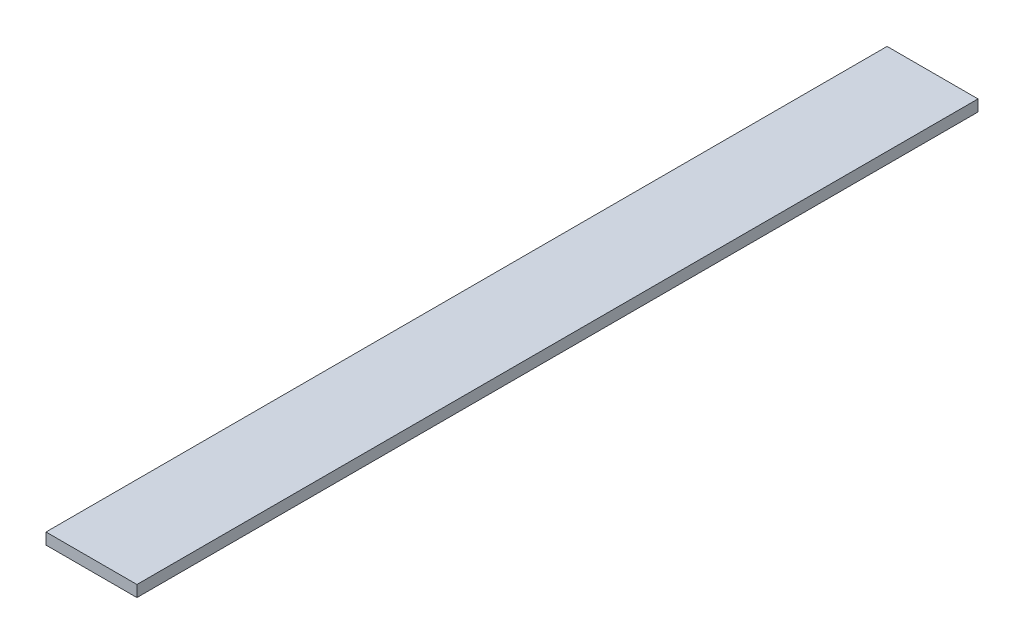
ISO-10303-21;
HEADER;
FILE_DESCRIPTION(('STEP AP214'),'2;1');
FILE_NAME('part.step','',(''),(''),'','','');
FILE_SCHEMA(('AUTOMOTIVE_DESIGN { 1 0 10303 214 1 1 1 1 }'));
ENDSEC;
DATA;
#1=APPLICATION_CONTEXT('core data for automotive mechanical design processes');
#2=APPLICATION_PROTOCOL_DEFINITION('international standard','automotive_design',2000,#1);
#3=PRODUCT_CONTEXT('',#1,'mechanical');
#4=PRODUCT('Part','Part','',(#3));
#5=PRODUCT_RELATED_PRODUCT_CATEGORY('part','',(#4));
#6=PRODUCT_DEFINITION_FORMATION('','',#4);
#7=PRODUCT_DEFINITION_CONTEXT('part definition',#1,'design');
#8=PRODUCT_DEFINITION('design','',#6,#7);
#9=PRODUCT_DEFINITION_SHAPE('','',#8);
#10=(LENGTH_UNIT() NAMED_UNIT(*) SI_UNIT(.MILLI.,.METRE.));
#11=(NAMED_UNIT(*) PLANE_ANGLE_UNIT() SI_UNIT($,.RADIAN.));
#12=(NAMED_UNIT(*) SI_UNIT($,.STERADIAN.) SOLID_ANGLE_UNIT());
#13=UNCERTAINTY_MEASURE_WITH_UNIT(LENGTH_MEASURE(1.E-05),#10,'distance_accuracy_value','');
#14=(GEOMETRIC_REPRESENTATION_CONTEXT(3) GLOBAL_UNCERTAINTY_ASSIGNED_CONTEXT((#13)) GLOBAL_UNIT_ASSIGNED_CONTEXT((#10,
#11,#12)) REPRESENTATION_CONTEXT('',''));
#15=CARTESIAN_POINT('',(0.,0.,0.));
#16=DIRECTION('',(0.,0.,1.));
#17=DIRECTION('',(1.,0.,0.));
#18=AXIS2_PLACEMENT_3D('',#15,#16,#17);
#19=CARTESIAN_POINT('',(-12.7,3.175,-117.475));
#20=DIRECTION('',(1.,0.,0.));
#21=DIRECTION('',(0.,0.,-1.));
#22=AXIS2_PLACEMENT_3D('',#19,#20,#21);
#23=PLANE('',#22);
#24=DIRECTION('',(0.,0.,1.));
#25=VECTOR('',#24,1.);
#26=CARTESIAN_POINT('',(-12.7,0.,-117.475));
#27=LINE('',#26,#25);
#28=CARTESIAN_POINT('',(-12.7,0.,-117.475));
#29=VERTEX_POINT('',#28);
#30=CARTESIAN_POINT('',(-12.7,0.,117.475));
#31=VERTEX_POINT('',#30);
#32=EDGE_CURVE('E108',#29,#31,#27,.T.);
#33=ORIENTED_EDGE('',*,*,#32,.T.);
#34=DIRECTION('',(0.,-1.,0.));
#35=VECTOR('',#34,1.);
#36=CARTESIAN_POINT('',(-12.7,3.175,117.475));
#37=LINE('',#36,#35);
#38=CARTESIAN_POINT('',(-12.7,3.175,117.475));
#39=VERTEX_POINT('',#38);
#40=EDGE_CURVE('E11',#39,#31,#37,.T.);
#41=ORIENTED_EDGE('',*,*,#40,.F.);
#42=DIRECTION('',(0.,0.,1.));
#43=VECTOR('',#42,1.);
#44=CARTESIAN_POINT('',(-12.7,3.175,-117.475));
#45=LINE('',#44,#43);
#46=CARTESIAN_POINT('',(-12.7,3.175,-117.475));
#47=VERTEX_POINT('',#46);
#48=EDGE_CURVE('E92',#47,#39,#45,.T.);
#49=ORIENTED_EDGE('',*,*,#48,.F.);
#50=DIRECTION('',(0.,-1.,0.));
#51=VECTOR('',#50,1.);
#52=CARTESIAN_POINT('',(-12.7,3.175,-117.475));
#53=LINE('',#52,#51);
#54=EDGE_CURVE('E104',#47,#29,#53,.T.);
#55=ORIENTED_EDGE('',*,*,#54,.T.);
#56=EDGE_LOOP('',(#33,#41,#49,#55));
#57=FACE_BOUND('',#56,.T.);
#58=ADVANCED_FACE('F39',(#57),#23,.F.);
#59=CARTESIAN_POINT('',(-12.7,3.175,117.475));
#60=DIRECTION('',(0.,0.,-1.));
#61=DIRECTION('',(-1.,0.,0.));
#62=AXIS2_PLACEMENT_3D('',#59,#60,#61);
#63=PLANE('',#62);
#64=DIRECTION('',(1.,0.,0.));
#65=VECTOR('',#64,1.);
#66=CARTESIAN_POINT('',(-12.7,0.,117.475));
#67=LINE('',#66,#65);
#68=CARTESIAN_POINT('',(12.7,0.,117.475));
#69=VERTEX_POINT('',#68);
#70=EDGE_CURVE('E97',#31,#69,#67,.T.);
#71=ORIENTED_EDGE('',*,*,#70,.T.);
#72=DIRECTION('',(0.,-1.,0.));
#73=VECTOR('',#72,1.);
#74=CARTESIAN_POINT('',(12.7,3.175,117.475));
#75=LINE('',#74,#73);
#76=CARTESIAN_POINT('',(12.7,3.175,117.475));
#77=VERTEX_POINT('',#76);
#78=EDGE_CURVE('E47',#77,#69,#75,.T.);
#79=ORIENTED_EDGE('',*,*,#78,.F.);
#80=DIRECTION('',(1.,0.,0.));
#81=VECTOR('',#80,1.);
#82=CARTESIAN_POINT('',(-12.7,3.175,117.475));
#83=LINE('',#82,#81);
#84=EDGE_CURVE('E87',#39,#77,#83,.T.);
#85=ORIENTED_EDGE('',*,*,#84,.F.);
#86=ORIENTED_EDGE('',*,*,#40,.T.);
#87=EDGE_LOOP('',(#71,#79,#85,#86));
#88=FACE_BOUND('',#87,.T.);
#89=ADVANCED_FACE('F96',(#88),#63,.F.);
#90=CARTESIAN_POINT('',(12.7,3.175,-117.475));
#91=DIRECTION('',(-1.,0.,0.));
#92=DIRECTION('',(0.,0.,1.));
#93=AXIS2_PLACEMENT_3D('',#90,#91,#92);
#94=PLANE('',#93);
#95=DIRECTION('',(0.,0.,-1.));
#96=VECTOR('',#95,1.);
#97=CARTESIAN_POINT('',(12.7,0.,-117.475));
#98=LINE('',#97,#96);
#99=CARTESIAN_POINT('',(12.7,0.,-117.475));
#100=VERTEX_POINT('',#99);
#101=EDGE_CURVE('E74',#69,#100,#98,.T.);
#102=ORIENTED_EDGE('',*,*,#101,.T.);
#103=DIRECTION('',(0.,-1.,0.));
#104=VECTOR('',#103,1.);
#105=CARTESIAN_POINT('',(12.7,3.175,-117.475));
#106=LINE('',#105,#104);
#107=CARTESIAN_POINT('',(12.7,3.175,-117.475));
#108=VERTEX_POINT('',#107);
#109=EDGE_CURVE('E98',#108,#100,#106,.T.);
#110=ORIENTED_EDGE('',*,*,#109,.F.);
#111=DIRECTION('',(0.,0.,-1.));
#112=VECTOR('',#111,1.);
#113=CARTESIAN_POINT('',(12.7,3.175,-117.475));
#114=LINE('',#113,#112);
#115=EDGE_CURVE('E90',#77,#108,#114,.T.);
#116=ORIENTED_EDGE('',*,*,#115,.F.);
#117=ORIENTED_EDGE('',*,*,#78,.T.);
#118=EDGE_LOOP('',(#102,#110,#116,#117));
#119=FACE_BOUND('',#118,.T.);
#120=ADVANCED_FACE('F99',(#119),#94,.F.);
#121=CARTESIAN_POINT('',(-12.7,3.175,-117.475));
#122=DIRECTION('',(0.,0.,1.));
#123=DIRECTION('',(1.,0.,0.));
#124=AXIS2_PLACEMENT_3D('',#121,#122,#123);
#125=PLANE('',#124);
#126=DIRECTION('',(-1.,0.,0.));
#127=VECTOR('',#126,1.);
#128=CARTESIAN_POINT('',(-12.7,0.,-117.475));
#129=LINE('',#128,#127);
#130=EDGE_CURVE('E80',#100,#29,#129,.T.);
#131=ORIENTED_EDGE('',*,*,#130,.T.);
#132=ORIENTED_EDGE('',*,*,#54,.F.);
#133=DIRECTION('',(-1.,0.,0.));
#134=VECTOR('',#133,1.);
#135=CARTESIAN_POINT('',(-12.7,3.175,-117.475));
#136=LINE('',#135,#134);
#137=EDGE_CURVE('E55',#108,#47,#136,.T.);
#138=ORIENTED_EDGE('',*,*,#137,.F.);
#139=ORIENTED_EDGE('',*,*,#109,.T.);
#140=EDGE_LOOP('',(#131,#132,#138,#139));
#141=FACE_BOUND('',#140,.T.);
#142=ADVANCED_FACE('F119',(#141),#125,.F.);
#143=CARTESIAN_POINT('',(0.,3.175,0.));
#144=DIRECTION('',(0.,1.,0.));
#145=DIRECTION('',(0.,0.,1.));
#146=AXIS2_PLACEMENT_3D('',#143,#144,#145);
#147=PLANE('',#146);
#148=ORIENTED_EDGE('',*,*,#48,.T.);
#149=ORIENTED_EDGE('',*,*,#84,.T.);
#150=ORIENTED_EDGE('',*,*,#115,.T.);
#151=ORIENTED_EDGE('',*,*,#137,.T.);
#152=EDGE_LOOP('',(#148,#149,#150,#151));
#153=FACE_BOUND('',#152,.T.);
#154=ADVANCED_FACE('F88',(#153),#147,.T.);
#155=CARTESIAN_POINT('',(0.,0.,0.));
#156=DIRECTION('',(0.,1.,0.));
#157=DIRECTION('',(0.,0.,1.));
#158=AXIS2_PLACEMENT_3D('',#155,#156,#157);
#159=PLANE('',#158);
#160=ORIENTED_EDGE('',*,*,#32,.F.);
#161=ORIENTED_EDGE('',*,*,#130,.F.);
#162=ORIENTED_EDGE('',*,*,#101,.F.);
#163=ORIENTED_EDGE('',*,*,#70,.F.);
#164=EDGE_LOOP('',(#160,#161,#162,#163));
#165=FACE_BOUND('',#164,.T.);
#166=ADVANCED_FACE('F122',(#165),#159,.F.);
#167=CLOSED_SHELL('',(#58,#89,#120,#142,#154,#166));
#168=MANIFOLD_SOLID_BREP('B2',#167);
#169=ADVANCED_BREP_SHAPE_REPRESENTATION('',(#18,#168),#14);
#170=SHAPE_DEFINITION_REPRESENTATION(#9,#169);
ENDSEC;
END-ISO-10303-21;
